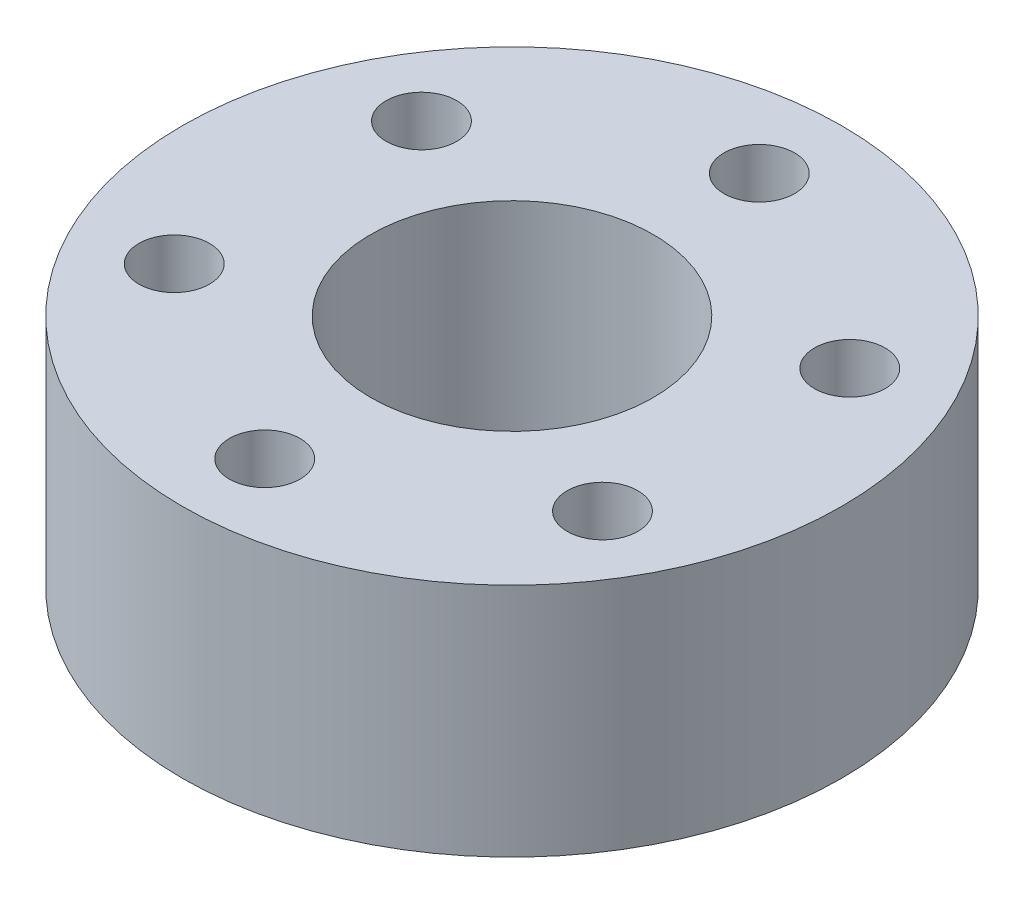
ISO-10303-21;
HEADER;
FILE_DESCRIPTION(('STEP AP214'),'2;1');
FILE_NAME('part.step','',(''),(''),'','','');
FILE_SCHEMA(('AUTOMOTIVE_DESIGN { 1 0 10303 214 1 1 1 1 }'));
ENDSEC;
DATA;
#1=APPLICATION_CONTEXT('core data for automotive mechanical design processes');
#2=APPLICATION_PROTOCOL_DEFINITION('international standard','automotive_design',2000,#1);
#3=PRODUCT_CONTEXT('',#1,'mechanical');
#4=PRODUCT('Part','Part','',(#3));
#5=PRODUCT_RELATED_PRODUCT_CATEGORY('part','',(#4));
#6=PRODUCT_DEFINITION_FORMATION('','',#4);
#7=PRODUCT_DEFINITION_CONTEXT('part definition',#1,'design');
#8=PRODUCT_DEFINITION('design','',#6,#7);
#9=PRODUCT_DEFINITION_SHAPE('','',#8);
#10=(LENGTH_UNIT() NAMED_UNIT(*) SI_UNIT(.MILLI.,.METRE.));
#11=(NAMED_UNIT(*) PLANE_ANGLE_UNIT() SI_UNIT($,.RADIAN.));
#12=(NAMED_UNIT(*) SI_UNIT($,.STERADIAN.) SOLID_ANGLE_UNIT());
#13=UNCERTAINTY_MEASURE_WITH_UNIT(LENGTH_MEASURE(1.E-05),#10,'distance_accuracy_value','');
#14=(GEOMETRIC_REPRESENTATION_CONTEXT(3) GLOBAL_UNCERTAINTY_ASSIGNED_CONTEXT((#13)) GLOBAL_UNIT_ASSIGNED_CONTEXT((#10,
#11,#12)) REPRESENTATION_CONTEXT('',''));
#15=CARTESIAN_POINT('',(0.,0.,0.));
#16=DIRECTION('',(0.,0.,1.));
#17=DIRECTION('',(1.,0.,0.));
#18=AXIS2_PLACEMENT_3D('',#15,#16,#17);
#19=CARTESIAN_POINT('',(0.,9.99999999999999,0.));
#20=DIRECTION('',(0.,-1.,0.));
#21=DIRECTION('',(0.,0.,-1.));
#22=AXIS2_PLACEMENT_3D('',#19,#20,#21);
#23=CYLINDRICAL_SURFACE('',#22,14.);
#24=CARTESIAN_POINT('',(0.,9.99999999999999,0.));
#25=DIRECTION('',(0.,1.,0.));
#26=DIRECTION('',(0.,0.,1.));
#27=AXIS2_PLACEMENT_3D('',#24,#25,#26);
#28=CIRCLE('',#27,14.);
#29=CARTESIAN_POINT('',(0.,9.99999999999999,14.));
#30=VERTEX_POINT('',#29);
#31=EDGE_CURVE('E12',#30,#30,#28,.T.);
#32=ORIENTED_EDGE('',*,*,#31,.F.);
#33=EDGE_LOOP('',(#32));
#34=FACE_BOUND('',#33,.T.);
#35=CARTESIAN_POINT('',(0.,0.,0.));
#36=DIRECTION('',(0.,1.,0.));
#37=DIRECTION('',(0.,0.,1.));
#38=AXIS2_PLACEMENT_3D('',#35,#36,#37);
#39=CIRCLE('',#38,14.);
#40=CARTESIAN_POINT('',(0.,0.,14.));
#41=VERTEX_POINT('',#40);
#42=EDGE_CURVE('E52',#41,#41,#39,.T.);
#43=ORIENTED_EDGE('',*,*,#42,.T.);
#44=EDGE_LOOP('',(#43));
#45=FACE_BOUND('',#44,.T.);
#46=ADVANCED_FACE('F49',(#34,#45),#23,.T.);
#47=CARTESIAN_POINT('',(0.,9.99999999999999,0.));
#48=DIRECTION('',(0.,1.,0.));
#49=DIRECTION('',(0.,0.,1.));
#50=AXIS2_PLACEMENT_3D('',#47,#48,#49);
#51=PLANE('',#50);
#52=CARTESIAN_POINT('',(0.,9.99999999999999,-10.5));
#53=DIRECTION('',(0.,1.,0.));
#54=DIRECTION('',(0.,0.,1.));
#55=AXIS2_PLACEMENT_3D('',#52,#53,#54);
#56=CIRCLE('',#55,1.5);
#57=CARTESIAN_POINT('',(0.,9.99999999999999,-9.00000000000002));
#58=VERTEX_POINT('',#57);
#59=EDGE_CURVE('E86',#58,#58,#56,.T.);
#60=ORIENTED_EDGE('',*,*,#59,.F.);
#61=EDGE_LOOP('',(#60));
#62=FACE_BOUND('',#61,.T.);
#63=CARTESIAN_POINT('',(-9.09326673973643,9.99999999999999,5.25000000000025));
#64=DIRECTION('',(0.,1.,0.));
#65=DIRECTION('',(0.,0.,1.));
#66=AXIS2_PLACEMENT_3D('',#63,#64,#65);
#67=CIRCLE('',#66,1.5);
#68=CARTESIAN_POINT('',(-9.09326673973643,9.99999999999999,6.75000000000025));
#69=VERTEX_POINT('',#68);
#70=EDGE_CURVE('E87',#69,#69,#67,.T.);
#71=ORIENTED_EDGE('',*,*,#70,.F.);
#72=EDGE_LOOP('',(#71));
#73=FACE_BOUND('',#72,.T.);
#74=CARTESIAN_POINT('',(1.02695629777827E-12,9.99999999999999,10.5));
#75=DIRECTION('',(0.,1.,0.));
#76=DIRECTION('',(0.,0.,1.));
#77=AXIS2_PLACEMENT_3D('',#74,#75,#76);
#78=CIRCLE('',#77,1.5);
#79=CARTESIAN_POINT('',(1.02703956450512E-12,9.99999999999999,12.));
#80=VERTEX_POINT('',#79);
#81=EDGE_CURVE('E93',#80,#80,#78,.T.);
#82=ORIENTED_EDGE('',*,*,#81,.F.);
#83=EDGE_LOOP('',(#82));
#84=FACE_BOUND('',#83,.T.);
#85=CARTESIAN_POINT('',(9.09326673973704,9.99999999999999,5.24999999999919));
#86=DIRECTION('',(0.,1.,0.));
#87=DIRECTION('',(0.,0.,1.));
#88=AXIS2_PLACEMENT_3D('',#85,#86,#87);
#89=CIRCLE('',#88,1.5);
#90=CARTESIAN_POINT('',(9.09326673973704,9.99999999999999,6.74999999999919));
#91=VERTEX_POINT('',#90);
#92=EDGE_CURVE('E61',#91,#91,#89,.T.);
#93=ORIENTED_EDGE('',*,*,#92,.F.);
#94=EDGE_LOOP('',(#93));
#95=FACE_BOUND('',#94,.T.);
#96=CARTESIAN_POINT('',(9.09326673973646,9.99999999999999,-5.25000000000023));
#97=DIRECTION('',(0.,1.,0.));
#98=DIRECTION('',(0.,0.,1.));
#99=AXIS2_PLACEMENT_3D('',#96,#97,#98);
#100=CIRCLE('',#99,1.5);
#101=CARTESIAN_POINT('',(9.09326673973646,9.99999999999999,-3.75000000000023));
#102=VERTEX_POINT('',#101);
#103=EDGE_CURVE('E68',#102,#102,#100,.T.);
#104=ORIENTED_EDGE('',*,*,#103,.F.);
#105=EDGE_LOOP('',(#104));
#106=FACE_BOUND('',#105,.T.);
#107=CARTESIAN_POINT('',(-9.09326673973657,9.99999999999999,-5.25000000000012));
#108=DIRECTION('',(0.,1.,0.));
#109=DIRECTION('',(0.,0.,1.));
#110=AXIS2_PLACEMENT_3D('',#107,#108,#109);
#111=CIRCLE('',#110,1.5);
#112=CARTESIAN_POINT('',(-9.09326673973657,9.99999999999999,-3.75000000000012));
#113=VERTEX_POINT('',#112);
#114=EDGE_CURVE('E74',#113,#113,#111,.T.);
#115=ORIENTED_EDGE('',*,*,#114,.F.);
#116=EDGE_LOOP('',(#115));
#117=FACE_BOUND('',#116,.T.);
#118=CARTESIAN_POINT('',(0.,9.99999999999999,0.));
#119=DIRECTION('',(0.,1.,0.));
#120=DIRECTION('',(0.,0.,1.));
#121=AXIS2_PLACEMENT_3D('',#118,#119,#120);
#122=CIRCLE('',#121,6.);
#123=CARTESIAN_POINT('',(0.,9.99999999999999,5.99999999999999));
#124=VERTEX_POINT('',#123);
#125=EDGE_CURVE('E80',#124,#124,#122,.T.);
#126=ORIENTED_EDGE('',*,*,#125,.F.);
#127=EDGE_LOOP('',(#126));
#128=FACE_BOUND('',#127,.T.);
#129=ORIENTED_EDGE('',*,*,#31,.T.);
#130=EDGE_LOOP('',(#129));
#131=FACE_BOUND('',#130,.T.);
#132=ADVANCED_FACE('F113',(#62,#73,#84,#95,#106,#117,#128,#131),#51,.T.);
#133=CARTESIAN_POINT('',(0.,0.,0.));
#134=DIRECTION('',(0.,1.,0.));
#135=DIRECTION('',(0.,0.,1.));
#136=AXIS2_PLACEMENT_3D('',#133,#134,#135);
#137=PLANE('',#136);
#138=CARTESIAN_POINT('',(0.,0.,-10.5));
#139=DIRECTION('',(0.,1.,0.));
#140=DIRECTION('',(0.,0.,1.));
#141=AXIS2_PLACEMENT_3D('',#138,#139,#140);
#142=CIRCLE('',#141,1.5);
#143=CARTESIAN_POINT('',(0.,0.,-8.99999999999998));
#144=VERTEX_POINT('',#143);
#145=EDGE_CURVE('E59',#144,#144,#142,.T.);
#146=ORIENTED_EDGE('',*,*,#145,.T.);
#147=EDGE_LOOP('',(#146));
#148=FACE_BOUND('',#147,.T.);
#149=CARTESIAN_POINT('',(-9.09326673973646,0.,5.2500000000003));
#150=DIRECTION('',(0.,1.,0.));
#151=DIRECTION('',(0.,0.,1.));
#152=AXIS2_PLACEMENT_3D('',#149,#150,#151);
#153=CIRCLE('',#152,1.5);
#154=CARTESIAN_POINT('',(-9.09326673973646,0.,6.7500000000003));
#155=VERTEX_POINT('',#154);
#156=EDGE_CURVE('E90',#155,#155,#153,.T.);
#157=ORIENTED_EDGE('',*,*,#156,.T.);
#158=EDGE_LOOP('',(#157));
#159=FACE_BOUND('',#158,.T.);
#160=CARTESIAN_POINT('',(9.99200722162641E-13,0.,10.5));
#161=DIRECTION('',(0.,1.,0.));
#162=DIRECTION('',(0.,0.,1.));
#163=AXIS2_PLACEMENT_3D('',#160,#161,#162);
#164=CIRCLE('',#163,1.5);
#165=CARTESIAN_POINT('',(9.99283988889488E-13,0.,12.));
#166=VERTEX_POINT('',#165);
#167=EDGE_CURVE('E65',#166,#166,#164,.T.);
#168=ORIENTED_EDGE('',*,*,#167,.T.);
#169=EDGE_LOOP('',(#168));
#170=FACE_BOUND('',#169,.T.);
#171=CARTESIAN_POINT('',(9.09326673973707,0.,5.24999999999919));
#172=DIRECTION('',(0.,1.,0.));
#173=DIRECTION('',(0.,0.,1.));
#174=AXIS2_PLACEMENT_3D('',#171,#172,#173);
#175=CIRCLE('',#174,1.5);
#176=CARTESIAN_POINT('',(9.09326673973707,0.,6.74999999999919));
#177=VERTEX_POINT('',#176);
#178=EDGE_CURVE('E64',#177,#177,#175,.T.);
#179=ORIENTED_EDGE('',*,*,#178,.T.);
#180=EDGE_LOOP('',(#179));
#181=FACE_BOUND('',#180,.T.);
#182=CARTESIAN_POINT('',(9.09326673973648,0.,-5.25000000000023));
#183=DIRECTION('',(0.,1.,0.));
#184=DIRECTION('',(0.,0.,1.));
#185=AXIS2_PLACEMENT_3D('',#182,#183,#184);
#186=CIRCLE('',#185,1.5);
#187=CARTESIAN_POINT('',(9.09326673973648,0.,-3.75000000000023));
#188=VERTEX_POINT('',#187);
#189=EDGE_CURVE('E71',#188,#188,#186,.T.);
#190=ORIENTED_EDGE('',*,*,#189,.T.);
#191=EDGE_LOOP('',(#190));
#192=FACE_BOUND('',#191,.T.);
#193=CARTESIAN_POINT('',(-9.09326673973657,0.,-5.25000000000012));
#194=DIRECTION('',(0.,1.,0.));
#195=DIRECTION('',(0.,0.,1.));
#196=AXIS2_PLACEMENT_3D('',#193,#194,#195);
#197=CIRCLE('',#196,1.5);
#198=CARTESIAN_POINT('',(-9.09326673973657,0.,-3.75000000000012));
#199=VERTEX_POINT('',#198);
#200=EDGE_CURVE('E77',#199,#199,#197,.T.);
#201=ORIENTED_EDGE('',*,*,#200,.T.);
#202=EDGE_LOOP('',(#201));
#203=FACE_BOUND('',#202,.T.);
#204=CARTESIAN_POINT('',(0.,0.,0.));
#205=DIRECTION('',(0.,1.,0.));
#206=DIRECTION('',(0.,0.,1.));
#207=AXIS2_PLACEMENT_3D('',#204,#205,#206);
#208=CIRCLE('',#207,6.);
#209=CARTESIAN_POINT('',(0.,0.,6.));
#210=VERTEX_POINT('',#209);
#211=EDGE_CURVE('E83',#210,#210,#208,.T.);
#212=ORIENTED_EDGE('',*,*,#211,.T.);
#213=EDGE_LOOP('',(#212));
#214=FACE_BOUND('',#213,.T.);
#215=ORIENTED_EDGE('',*,*,#42,.F.);
#216=EDGE_LOOP('',(#215));
#217=FACE_BOUND('',#216,.T.);
#218=ADVANCED_FACE('F103',(#148,#159,#170,#181,#192,#203,#214,#217),#137,.F.);
#219=CARTESIAN_POINT('',(0.,0.,0.));
#220=DIRECTION('',(0.,1.,0.));
#221=DIRECTION('',(0.,0.,1.));
#222=AXIS2_PLACEMENT_3D('',#219,#220,#221);
#223=CYLINDRICAL_SURFACE('',#222,6.);
#224=ORIENTED_EDGE('',*,*,#211,.F.);
#225=EDGE_LOOP('',(#224));
#226=FACE_BOUND('',#225,.T.);
#227=ORIENTED_EDGE('',*,*,#125,.T.);
#228=EDGE_LOOP('',(#227));
#229=FACE_BOUND('',#228,.T.);
#230=ADVANCED_FACE('F129',(#226,#229),#223,.F.);
#231=CARTESIAN_POINT('',(-9.09326673973657,0.,-5.25000000000012));
#232=DIRECTION('',(0.,1.,0.));
#233=DIRECTION('',(0.,0.,1.));
#234=AXIS2_PLACEMENT_3D('',#231,#232,#233);
#235=CYLINDRICAL_SURFACE('',#234,1.5);
#236=ORIENTED_EDGE('',*,*,#200,.F.);
#237=EDGE_LOOP('',(#236));
#238=FACE_BOUND('',#237,.T.);
#239=ORIENTED_EDGE('',*,*,#114,.T.);
#240=EDGE_LOOP('',(#239));
#241=FACE_BOUND('',#240,.T.);
#242=ADVANCED_FACE('F131',(#238,#241),#235,.F.);
#243=CARTESIAN_POINT('',(9.09326673973648,0.,-5.25000000000023));
#244=DIRECTION('',(0.,1.,0.));
#245=DIRECTION('',(0.,0.,1.));
#246=AXIS2_PLACEMENT_3D('',#243,#244,#245);
#247=CYLINDRICAL_SURFACE('',#246,1.5);
#248=ORIENTED_EDGE('',*,*,#189,.F.);
#249=EDGE_LOOP('',(#248));
#250=FACE_BOUND('',#249,.T.);
#251=ORIENTED_EDGE('',*,*,#103,.T.);
#252=EDGE_LOOP('',(#251));
#253=FACE_BOUND('',#252,.T.);
#254=ADVANCED_FACE('F138',(#250,#253),#247,.F.);
#255=CARTESIAN_POINT('',(9.09326673973707,0.,5.24999999999919));
#256=DIRECTION('',(0.,1.,0.));
#257=DIRECTION('',(0.,0.,1.));
#258=AXIS2_PLACEMENT_3D('',#255,#256,#257);
#259=CYLINDRICAL_SURFACE('',#258,1.5);
#260=ORIENTED_EDGE('',*,*,#178,.F.);
#261=EDGE_LOOP('',(#260));
#262=FACE_BOUND('',#261,.T.);
#263=ORIENTED_EDGE('',*,*,#92,.T.);
#264=EDGE_LOOP('',(#263));
#265=FACE_BOUND('',#264,.T.);
#266=ADVANCED_FACE('F172',(#262,#265),#259,.F.);
#267=CARTESIAN_POINT('',(9.99200722162641E-13,0.,10.5));
#268=DIRECTION('',(0.,1.,0.));
#269=DIRECTION('',(0.,0.,1.));
#270=AXIS2_PLACEMENT_3D('',#267,#268,#269);
#271=CYLINDRICAL_SURFACE('',#270,1.5);
#272=ORIENTED_EDGE('',*,*,#167,.F.);
#273=EDGE_LOOP('',(#272));
#274=FACE_BOUND('',#273,.T.);
#275=ORIENTED_EDGE('',*,*,#81,.T.);
#276=EDGE_LOOP('',(#275));
#277=FACE_BOUND('',#276,.T.);
#278=ADVANCED_FACE('F181',(#274,#277),#271,.F.);
#279=CARTESIAN_POINT('',(-9.09326673973646,0.,5.2500000000003));
#280=DIRECTION('',(0.,1.,0.));
#281=DIRECTION('',(0.,0.,1.));
#282=AXIS2_PLACEMENT_3D('',#279,#280,#281);
#283=CYLINDRICAL_SURFACE('',#282,1.5);
#284=ORIENTED_EDGE('',*,*,#156,.F.);
#285=EDGE_LOOP('',(#284));
#286=FACE_BOUND('',#285,.T.);
#287=ORIENTED_EDGE('',*,*,#70,.T.);
#288=EDGE_LOOP('',(#287));
#289=FACE_BOUND('',#288,.T.);
#290=ADVANCED_FACE('F109',(#286,#289),#283,.F.);
#291=CARTESIAN_POINT('',(0.,0.,-10.5));
#292=DIRECTION('',(0.,1.,0.));
#293=DIRECTION('',(0.,0.,1.));
#294=AXIS2_PLACEMENT_3D('',#291,#292,#293);
#295=CYLINDRICAL_SURFACE('',#294,1.5);
#296=ORIENTED_EDGE('',*,*,#145,.F.);
#297=EDGE_LOOP('',(#296));
#298=FACE_BOUND('',#297,.T.);
#299=ORIENTED_EDGE('',*,*,#59,.T.);
#300=EDGE_LOOP('',(#299));
#301=FACE_BOUND('',#300,.T.);
#302=ADVANCED_FACE('F106',(#298,#301),#295,.F.);
#303=CLOSED_SHELL('',(#46,#132,#218,#230,#242,#254,#266,#278,#290,#302));
#304=MANIFOLD_SOLID_BREP('B2',#303);
#305=ADVANCED_BREP_SHAPE_REPRESENTATION('',(#18,#304),#14);
#306=SHAPE_DEFINITION_REPRESENTATION(#9,#305);
ENDSEC;
END-ISO-10303-21;
